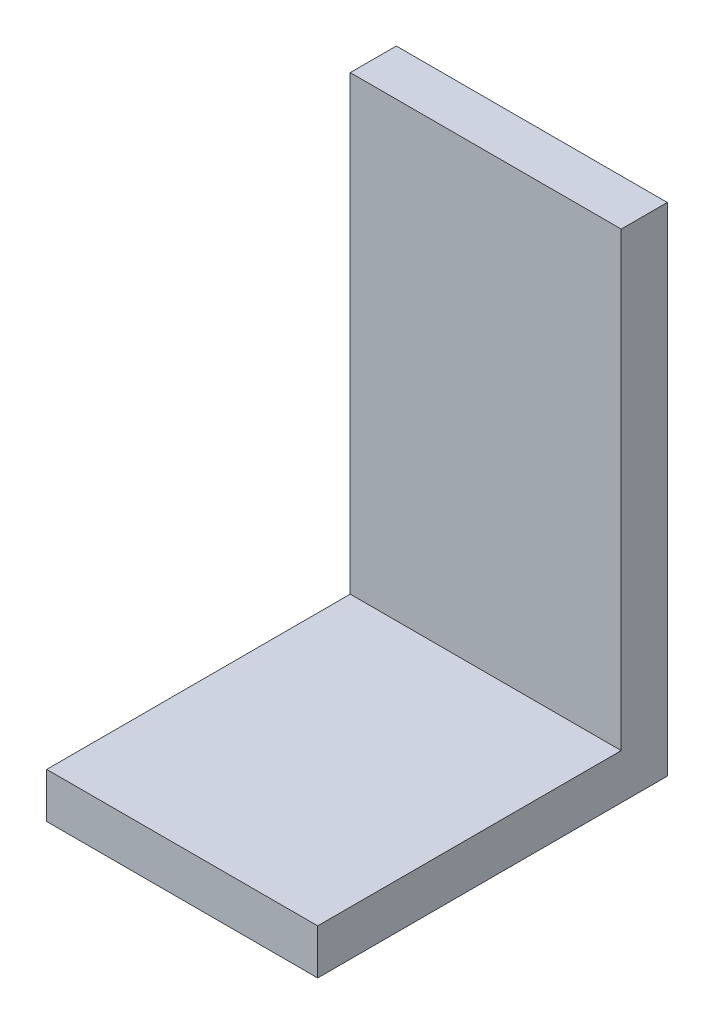
ISO-10303-21;
HEADER;
FILE_DESCRIPTION(('STEP AP214'),'2;1');
FILE_NAME('part.step','',(''),(''),'','','');
FILE_SCHEMA(('AUTOMOTIVE_DESIGN { 1 0 10303 214 1 1 1 1 }'));
ENDSEC;
DATA;
#1=APPLICATION_CONTEXT('core data for automotive mechanical design processes');
#2=APPLICATION_PROTOCOL_DEFINITION('international standard','automotive_design',2000,#1);
#3=PRODUCT_CONTEXT('',#1,'mechanical');
#4=PRODUCT('Part','Part','',(#3));
#5=PRODUCT_RELATED_PRODUCT_CATEGORY('part','',(#4));
#6=PRODUCT_DEFINITION_FORMATION('','',#4);
#7=PRODUCT_DEFINITION_CONTEXT('part definition',#1,'design');
#8=PRODUCT_DEFINITION('design','',#6,#7);
#9=PRODUCT_DEFINITION_SHAPE('','',#8);
#10=(LENGTH_UNIT() NAMED_UNIT(*) SI_UNIT(.MILLI.,.METRE.));
#11=(NAMED_UNIT(*) PLANE_ANGLE_UNIT() SI_UNIT($,.RADIAN.));
#12=(NAMED_UNIT(*) SI_UNIT($,.STERADIAN.) SOLID_ANGLE_UNIT());
#13=UNCERTAINTY_MEASURE_WITH_UNIT(LENGTH_MEASURE(1.E-05),#10,'distance_accuracy_value','');
#14=(GEOMETRIC_REPRESENTATION_CONTEXT(3) GLOBAL_UNCERTAINTY_ASSIGNED_CONTEXT((#13)) GLOBAL_UNIT_ASSIGNED_CONTEXT((#10,
#11,#12)) REPRESENTATION_CONTEXT('',''));
#15=CARTESIAN_POINT('',(0.,0.,0.));
#16=DIRECTION('',(0.,0.,1.));
#17=DIRECTION('',(1.,0.,0.));
#18=AXIS2_PLACEMENT_3D('',#15,#16,#17);
#19=CARTESIAN_POINT('',(2.9,-4.55,0.));
#20=DIRECTION('',(1.,0.,0.));
#21=DIRECTION('',(0.,0.,1.));
#22=AXIS2_PLACEMENT_3D('',#19,#20,#21);
#23=PLANE('',#22);
#24=DIRECTION('',(0.,-1.,0.));
#25=VECTOR('',#24,1.);
#26=CARTESIAN_POINT('',(2.9,-4.,0.));
#27=LINE('',#26,#25);
#28=CARTESIAN_POINT('',(2.9,-4.,0.));
#29=VERTEX_POINT('',#28);
#30=CARTESIAN_POINT('',(2.9,-4.55,0.));
#31=VERTEX_POINT('',#30);
#32=EDGE_CURVE('E11',#29,#31,#27,.T.);
#33=ORIENTED_EDGE('',*,*,#32,.F.);
#34=DIRECTION('',(0.,0.,-1.));
#35=VECTOR('',#34,1.);
#36=CARTESIAN_POINT('',(2.9,-4.,0.051));
#37=LINE('',#36,#35);
#38=CARTESIAN_POINT('',(2.9,-4.,0.051));
#39=VERTEX_POINT('',#38);
#40=EDGE_CURVE('E24',#39,#29,#37,.T.);
#41=ORIENTED_EDGE('',*,*,#40,.F.);
#42=DIRECTION('',(0.,1.,0.));
#43=VECTOR('',#42,1.);
#44=CARTESIAN_POINT('',(2.9,-4.5,0.051));
#45=LINE('',#44,#43);
#46=CARTESIAN_POINT('',(2.9,-4.5,0.051));
#47=VERTEX_POINT('',#46);
#48=EDGE_CURVE('E87',#47,#39,#45,.T.);
#49=ORIENTED_EDGE('',*,*,#48,.F.);
#50=DIRECTION('',(0.,0.,-1.));
#51=VECTOR('',#50,1.);
#52=CARTESIAN_POINT('',(2.9,-4.5,0.387));
#53=LINE('',#52,#51);
#54=CARTESIAN_POINT('',(2.9,-4.5,0.387));
#55=VERTEX_POINT('',#54);
#56=EDGE_CURVE('E114',#55,#47,#53,.T.);
#57=ORIENTED_EDGE('',*,*,#56,.F.);
#58=DIRECTION('',(0.,1.,0.));
#59=VECTOR('',#58,1.);
#60=CARTESIAN_POINT('',(2.9,-4.55,0.387));
#61=LINE('',#60,#59);
#62=CARTESIAN_POINT('',(2.9,-4.55,0.387));
#63=VERTEX_POINT('',#62);
#64=EDGE_CURVE('E111',#63,#55,#61,.T.);
#65=ORIENTED_EDGE('',*,*,#64,.F.);
#66=DIRECTION('',(0.,0.,1.));
#67=VECTOR('',#66,1.);
#68=CARTESIAN_POINT('',(2.9,-4.55,0.));
#69=LINE('',#68,#67);
#70=EDGE_CURVE('E108',#31,#63,#69,.T.);
#71=ORIENTED_EDGE('',*,*,#70,.F.);
#72=EDGE_LOOP('',(#33,#41,#49,#57,#65,#71));
#73=FACE_BOUND('',#72,.T.);
#74=ADVANCED_FACE('F17',(#73),#23,.T.);
#75=CARTESIAN_POINT('',(2.6,-4.,0.));
#76=DIRECTION('',(-1.,0.,0.));
#77=DIRECTION('',(0.,0.,1.));
#78=AXIS2_PLACEMENT_3D('',#75,#76,#77);
#79=PLANE('',#78);
#80=DIRECTION('',(0.,1.,0.));
#81=VECTOR('',#80,1.);
#82=CARTESIAN_POINT('',(2.6,-4.55,0.));
#83=LINE('',#82,#81);
#84=CARTESIAN_POINT('',(2.6,-4.55,0.));
#85=VERTEX_POINT('',#84);
#86=CARTESIAN_POINT('',(2.6,-4.,0.));
#87=VERTEX_POINT('',#86);
#88=EDGE_CURVE('E106',#85,#87,#83,.T.);
#89=ORIENTED_EDGE('',*,*,#88,.F.);
#90=DIRECTION('',(0.,0.,-1.));
#91=VECTOR('',#90,1.);
#92=CARTESIAN_POINT('',(2.6,-4.55,0.387));
#93=LINE('',#92,#91);
#94=CARTESIAN_POINT('',(2.6,-4.55,0.387));
#95=VERTEX_POINT('',#94);
#96=EDGE_CURVE('E103',#95,#85,#93,.T.);
#97=ORIENTED_EDGE('',*,*,#96,.F.);
#98=DIRECTION('',(0.,-1.,0.));
#99=VECTOR('',#98,1.);
#100=CARTESIAN_POINT('',(2.6,-4.5,0.387));
#101=LINE('',#100,#99);
#102=CARTESIAN_POINT('',(2.6,-4.5,0.387));
#103=VERTEX_POINT('',#102);
#104=EDGE_CURVE('E100',#103,#95,#101,.T.);
#105=ORIENTED_EDGE('',*,*,#104,.F.);
#106=DIRECTION('',(0.,0.,1.));
#107=VECTOR('',#106,1.);
#108=CARTESIAN_POINT('',(2.6,-4.5,0.051));
#109=LINE('',#108,#107);
#110=CARTESIAN_POINT('',(2.6,-4.5,0.051));
#111=VERTEX_POINT('',#110);
#112=EDGE_CURVE('E72',#111,#103,#109,.T.);
#113=ORIENTED_EDGE('',*,*,#112,.F.);
#114=DIRECTION('',(0.,-1.,0.));
#115=VECTOR('',#114,1.);
#116=CARTESIAN_POINT('',(2.6,-4.,0.051));
#117=LINE('',#116,#115);
#118=CARTESIAN_POINT('',(2.6,-4.,0.051));
#119=VERTEX_POINT('',#118);
#120=EDGE_CURVE('E66',#119,#111,#117,.T.);
#121=ORIENTED_EDGE('',*,*,#120,.F.);
#122=DIRECTION('',(0.,0.,1.));
#123=VECTOR('',#122,1.);
#124=CARTESIAN_POINT('',(2.6,-4.,0.));
#125=LINE('',#124,#123);
#126=EDGE_CURVE('E69',#87,#119,#125,.T.);
#127=ORIENTED_EDGE('',*,*,#126,.F.);
#128=EDGE_LOOP('',(#89,#97,#105,#113,#121,#127));
#129=FACE_BOUND('',#128,.T.);
#130=ADVANCED_FACE('F68',(#129),#79,.T.);
#131=CARTESIAN_POINT('',(2.9,-4.55,0.387));
#132=DIRECTION('',(0.,0.,1.));
#133=DIRECTION('',(0.,1.,0.));
#134=AXIS2_PLACEMENT_3D('',#131,#132,#133);
#135=PLANE('',#134);
#136=ORIENTED_EDGE('',*,*,#64,.T.);
#137=DIRECTION('',(1.,0.,0.));
#138=VECTOR('',#137,1.);
#139=CARTESIAN_POINT('',(2.6,-4.5,0.387));
#140=LINE('',#139,#138);
#141=EDGE_CURVE('E83',#103,#55,#140,.T.);
#142=ORIENTED_EDGE('',*,*,#141,.F.);
#143=ORIENTED_EDGE('',*,*,#104,.T.);
#144=DIRECTION('',(-1.,0.,0.));
#145=VECTOR('',#144,1.);
#146=CARTESIAN_POINT('',(2.9,-4.55,0.387));
#147=LINE('',#146,#145);
#148=EDGE_CURVE('E88',#63,#95,#147,.T.);
#149=ORIENTED_EDGE('',*,*,#148,.F.);
#150=EDGE_LOOP('',(#136,#142,#143,#149));
#151=FACE_BOUND('',#150,.T.);
#152=ADVANCED_FACE('F125',(#151),#135,.T.);
#153=CARTESIAN_POINT('',(2.9,-4.5,0.051));
#154=DIRECTION('',(0.,0.,1.));
#155=DIRECTION('',(0.,1.,0.));
#156=AXIS2_PLACEMENT_3D('',#153,#154,#155);
#157=PLANE('',#156);
#158=ORIENTED_EDGE('',*,*,#48,.T.);
#159=DIRECTION('',(1.,0.,0.));
#160=VECTOR('',#159,1.);
#161=CARTESIAN_POINT('',(2.6,-4.,0.051));
#162=LINE('',#161,#160);
#163=EDGE_CURVE('E81',#119,#39,#162,.T.);
#164=ORIENTED_EDGE('',*,*,#163,.F.);
#165=ORIENTED_EDGE('',*,*,#120,.T.);
#166=DIRECTION('',(-1.,0.,0.));
#167=VECTOR('',#166,1.);
#168=CARTESIAN_POINT('',(2.9,-4.5,0.051));
#169=LINE('',#168,#167);
#170=EDGE_CURVE('E89',#47,#111,#169,.T.);
#171=ORIENTED_EDGE('',*,*,#170,.F.);
#172=EDGE_LOOP('',(#158,#164,#165,#171));
#173=FACE_BOUND('',#172,.T.);
#174=ADVANCED_FACE('F86',(#173),#157,.T.);
#175=CARTESIAN_POINT('',(2.6,-4.55,0.));
#176=DIRECTION('',(0.,-1.,0.));
#177=DIRECTION('',(0.,0.,1.));
#178=AXIS2_PLACEMENT_3D('',#175,#176,#177);
#179=PLANE('',#178);
#180=DIRECTION('',(-1.,0.,0.));
#181=VECTOR('',#180,1.);
#182=CARTESIAN_POINT('',(2.9,-4.55,0.));
#183=LINE('',#182,#181);
#184=EDGE_CURVE('E93',#31,#85,#183,.T.);
#185=ORIENTED_EDGE('',*,*,#184,.F.);
#186=ORIENTED_EDGE('',*,*,#70,.T.);
#187=ORIENTED_EDGE('',*,*,#148,.T.);
#188=ORIENTED_EDGE('',*,*,#96,.T.);
#189=EDGE_LOOP('',(#185,#186,#187,#188));
#190=FACE_BOUND('',#189,.T.);
#191=ADVANCED_FACE('F121',(#190),#179,.T.);
#192=CARTESIAN_POINT('',(2.9,-4.,0.));
#193=DIRECTION('',(0.,1.,0.));
#194=DIRECTION('',(0.,0.,1.));
#195=AXIS2_PLACEMENT_3D('',#192,#193,#194);
#196=PLANE('',#195);
#197=DIRECTION('',(1.,0.,0.));
#198=VECTOR('',#197,1.);
#199=CARTESIAN_POINT('',(2.6,-4.,0.));
#200=LINE('',#199,#198);
#201=EDGE_CURVE('E82',#87,#29,#200,.T.);
#202=ORIENTED_EDGE('',*,*,#201,.F.);
#203=ORIENTED_EDGE('',*,*,#126,.T.);
#204=ORIENTED_EDGE('',*,*,#163,.T.);
#205=ORIENTED_EDGE('',*,*,#40,.T.);
#206=EDGE_LOOP('',(#202,#203,#204,#205));
#207=FACE_BOUND('',#206,.T.);
#208=ADVANCED_FACE('F80',(#207),#196,.T.);
#209=CARTESIAN_POINT('',(2.9,-4.5,0.051));
#210=DIRECTION('',(0.,1.,0.));
#211=DIRECTION('',(0.,0.,1.));
#212=AXIS2_PLACEMENT_3D('',#209,#210,#211);
#213=PLANE('',#212);
#214=ORIENTED_EDGE('',*,*,#170,.T.);
#215=ORIENTED_EDGE('',*,*,#112,.T.);
#216=ORIENTED_EDGE('',*,*,#141,.T.);
#217=ORIENTED_EDGE('',*,*,#56,.T.);
#218=EDGE_LOOP('',(#214,#215,#216,#217));
#219=FACE_BOUND('',#218,.T.);
#220=ADVANCED_FACE('F127',(#219),#213,.T.);
#221=CARTESIAN_POINT('',(2.6,-4.55,0.));
#222=DIRECTION('',(0.,0.,-1.));
#223=DIRECTION('',(0.,1.,0.));
#224=AXIS2_PLACEMENT_3D('',#221,#222,#223);
#225=PLANE('',#224);
#226=ORIENTED_EDGE('',*,*,#88,.T.);
#227=ORIENTED_EDGE('',*,*,#201,.T.);
#228=ORIENTED_EDGE('',*,*,#32,.T.);
#229=ORIENTED_EDGE('',*,*,#184,.T.);
#230=EDGE_LOOP('',(#226,#227,#228,#229));
#231=FACE_BOUND('',#230,.T.);
#232=ADVANCED_FACE('F117',(#231),#225,.T.);
#233=CLOSED_SHELL('',(#74,#130,#152,#174,#191,#208,#220,#232));
#234=MANIFOLD_SOLID_BREP('B1',#233);
#235=ADVANCED_BREP_SHAPE_REPRESENTATION('',(#18,#234),#14);
#236=SHAPE_DEFINITION_REPRESENTATION(#9,#235);
ENDSEC;
END-ISO-10303-21;
